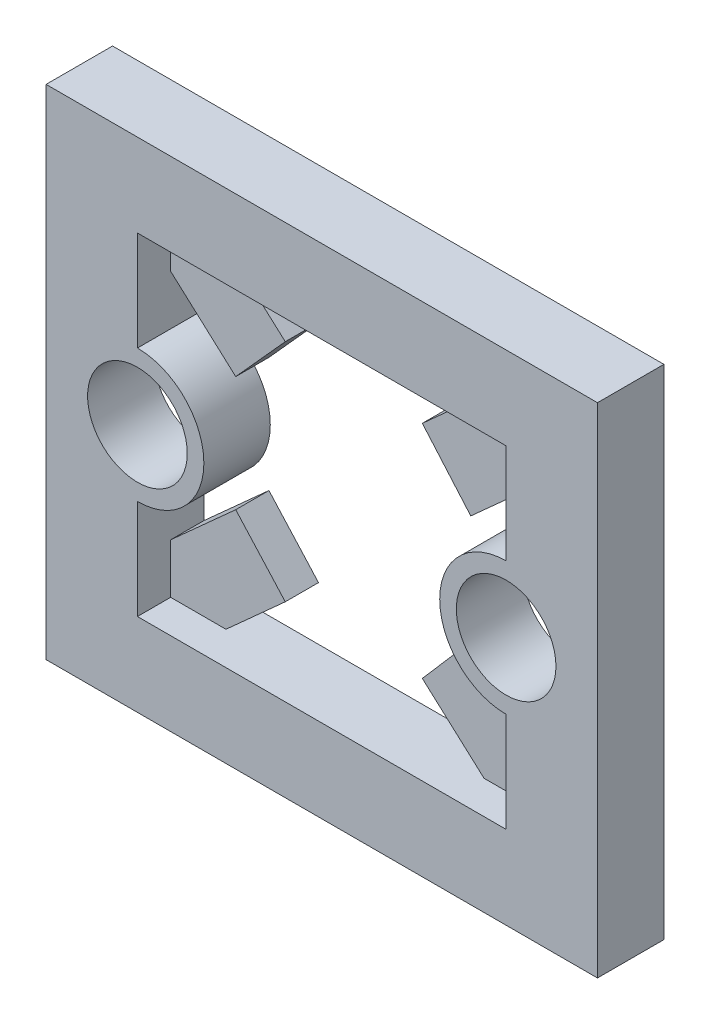
ISO-10303-21;
HEADER;
FILE_DESCRIPTION(('STEP AP214'),'2;1');
FILE_NAME('part.step','',(''),(''),'','','');
FILE_SCHEMA(('AUTOMOTIVE_DESIGN { 1 0 10303 214 1 1 1 1 }'));
ENDSEC;
DATA;
#1=APPLICATION_CONTEXT('core data for automotive mechanical design processes');
#2=APPLICATION_PROTOCOL_DEFINITION('international standard','automotive_design',2000,#1);
#3=PRODUCT_CONTEXT('',#1,'mechanical');
#4=PRODUCT('Part','Part','',(#3));
#5=PRODUCT_RELATED_PRODUCT_CATEGORY('part','',(#4));
#6=PRODUCT_DEFINITION_FORMATION('','',#4);
#7=PRODUCT_DEFINITION_CONTEXT('part definition',#1,'design');
#8=PRODUCT_DEFINITION('design','',#6,#7);
#9=PRODUCT_DEFINITION_SHAPE('','',#8);
#10=(LENGTH_UNIT() NAMED_UNIT(*) SI_UNIT(.MILLI.,.METRE.));
#11=(NAMED_UNIT(*) PLANE_ANGLE_UNIT() SI_UNIT($,.RADIAN.));
#12=(NAMED_UNIT(*) SI_UNIT($,.STERADIAN.) SOLID_ANGLE_UNIT());
#13=UNCERTAINTY_MEASURE_WITH_UNIT(LENGTH_MEASURE(1.E-05),#10,'distance_accuracy_value','');
#14=(GEOMETRIC_REPRESENTATION_CONTEXT(3) GLOBAL_UNCERTAINTY_ASSIGNED_CONTEXT((#13)) GLOBAL_UNIT_ASSIGNED_CONTEXT((#10,
#11,#12)) REPRESENTATION_CONTEXT('',''));
#15=CARTESIAN_POINT('',(0.,0.,0.));
#16=DIRECTION('',(0.,0.,1.));
#17=DIRECTION('',(1.,0.,0.));
#18=AXIS2_PLACEMENT_3D('',#15,#16,#17);
#19=CARTESIAN_POINT('',(6.908038,0.,2.));
#20=DIRECTION('',(1.,0.,0.));
#21=DIRECTION('',(0.,0.,-1.));
#22=AXIS2_PLACEMENT_3D('',#19,#20,#21);
#23=PLANE('',#22);
#24=DIRECTION('',(0.,-1.,0.));
#25=VECTOR('',#24,1.);
#26=CARTESIAN_POINT('',(6.908038,0.,1.));
#27=LINE('',#26,#25);
#28=CARTESIAN_POINT('',(6.908038,9.59496999999999,1.));
#29=VERTEX_POINT('',#28);
#30=CARTESIAN_POINT('',(6.908038,8.09496999999999,1.));
#31=VERTEX_POINT('',#30);
#32=EDGE_CURVE('E60',#29,#31,#27,.T.);
#33=ORIENTED_EDGE('',*,*,#32,.F.);
#34=DIRECTION('',(0.,0.,-1.));
#35=VECTOR('',#34,1.);
#36=CARTESIAN_POINT('',(6.908038,9.59496999999999,1.));
#37=LINE('',#36,#35);
#38=CARTESIAN_POINT('',(6.908038,9.59496999999999,0.));
#39=VERTEX_POINT('',#38);
#40=EDGE_CURVE('E234',#29,#39,#37,.T.);
#41=ORIENTED_EDGE('',*,*,#40,.T.);
#42=DIRECTION('',(0.,-1.,0.));
#43=VECTOR('',#42,1.);
#44=CARTESIAN_POINT('',(6.908038,0.,0.));
#45=LINE('',#44,#43);
#46=CARTESIAN_POINT('',(6.908038,11.09497,0.));
#47=VERTEX_POINT('',#46);
#48=EDGE_CURVE('E405',#47,#39,#45,.T.);
#49=ORIENTED_EDGE('',*,*,#48,.F.);
#50=DIRECTION('',(0.,0.,-1.));
#51=VECTOR('',#50,1.);
#52=CARTESIAN_POINT('',(6.908038,11.09497,2.));
#53=LINE('',#52,#51);
#54=CARTESIAN_POINT('',(6.908038,11.09497,2.));
#55=VERTEX_POINT('',#54);
#56=EDGE_CURVE('E387',#55,#47,#53,.T.);
#57=ORIENTED_EDGE('',*,*,#56,.F.);
#58=DIRECTION('',(0.,-1.,0.));
#59=VECTOR('',#58,1.);
#60=CARTESIAN_POINT('',(6.908038,0.,2.));
#61=LINE('',#60,#59);
#62=CARTESIAN_POINT('',(6.908038,8.09496999999999,2.));
#63=VERTEX_POINT('',#62);
#64=EDGE_CURVE('E370',#55,#63,#61,.T.);
#65=ORIENTED_EDGE('',*,*,#64,.T.);
#66=DIRECTION('',(0.,0.,-1.));
#67=VECTOR('',#66,1.);
#68=CARTESIAN_POINT('',(6.908038,8.09496999999999,2.));
#69=LINE('',#68,#67);
#70=EDGE_CURVE('E429',#63,#31,#69,.T.);
#71=ORIENTED_EDGE('',*,*,#70,.T.);
#72=EDGE_LOOP('',(#33,#41,#49,#57,#65,#71));
#73=FACE_BOUND('',#72,.T.);
#74=ADVANCED_FACE('F35',(#73),#23,.T.);
#75=CARTESIAN_POINT('',(0.,8.09496999999999,2.));
#76=DIRECTION('',(0.,-1.,0.));
#77=DIRECTION('',(1.,0.,0.));
#78=AXIS2_PLACEMENT_3D('',#75,#76,#77);
#79=PLANE('',#78);
#80=DIRECTION('',(-1.,0.,0.));
#81=VECTOR('',#80,1.);
#82=CARTESIAN_POINT('',(0.,8.09496999999999,0.));
#83=LINE('',#82,#81);
#84=CARTESIAN_POINT('',(16.3430839,8.09497,0.));
#85=VERTEX_POINT('',#84);
#86=CARTESIAN_POINT('',(8.57304610000001,8.09497,0.));
#87=VERTEX_POINT('',#86);
#88=EDGE_CURVE('E403',#85,#87,#83,.T.);
#89=ORIENTED_EDGE('',*,*,#88,.T.);
#90=DIRECTION('',(0.,0.,-1.));
#91=VECTOR('',#90,1.);
#92=CARTESIAN_POINT('',(8.57304610000001,8.09497,1.));
#93=LINE('',#92,#91);
#94=CARTESIAN_POINT('',(8.57304610000001,8.09496999999999,1.));
#95=VERTEX_POINT('',#94);
#96=EDGE_CURVE('E52',#95,#87,#93,.T.);
#97=ORIENTED_EDGE('',*,*,#96,.F.);
#98=DIRECTION('',(-1.,0.,0.));
#99=VECTOR('',#98,1.);
#100=CARTESIAN_POINT('',(0.,8.09496999999999,1.));
#101=LINE('',#100,#99);
#102=EDGE_CURVE('E251',#95,#31,#101,.T.);
#103=ORIENTED_EDGE('',*,*,#102,.T.);
#104=ORIENTED_EDGE('',*,*,#70,.F.);
#105=DIRECTION('',(-1.,0.,0.));
#106=VECTOR('',#105,1.);
#107=CARTESIAN_POINT('',(0.,8.09496999999999,2.));
#108=LINE('',#107,#106);
#109=CARTESIAN_POINT('',(18.008092,8.09497,2.));
#110=VERTEX_POINT('',#109);
#111=EDGE_CURVE('E368',#110,#63,#108,.T.);
#112=ORIENTED_EDGE('',*,*,#111,.F.);
#113=DIRECTION('',(0.,0.,-1.));
#114=VECTOR('',#113,1.);
#115=CARTESIAN_POINT('',(18.008092,8.09497,2.));
#116=LINE('',#115,#114);
#117=CARTESIAN_POINT('',(18.008092,8.09497,1.));
#118=VERTEX_POINT('',#117);
#119=EDGE_CURVE('E431',#110,#118,#116,.T.);
#120=ORIENTED_EDGE('',*,*,#119,.T.);
#121=DIRECTION('',(-1.,0.,0.));
#122=VECTOR('',#121,1.);
#123=CARTESIAN_POINT('',(0.,8.09496999999999,1.));
#124=LINE('',#123,#122);
#125=CARTESIAN_POINT('',(16.3430839,8.09497,1.));
#126=VERTEX_POINT('',#125);
#127=EDGE_CURVE('E270',#118,#126,#124,.T.);
#128=ORIENTED_EDGE('',*,*,#127,.T.);
#129=DIRECTION('',(0.,0.,-1.));
#130=VECTOR('',#129,1.);
#131=CARTESIAN_POINT('',(16.3430839,8.09497,1.));
#132=LINE('',#131,#130);
#133=EDGE_CURVE('E284',#126,#85,#132,.T.);
#134=ORIENTED_EDGE('',*,*,#133,.T.);
#135=EDGE_LOOP('',(#89,#97,#103,#104,#112,#120,#128,#134));
#136=FACE_BOUND('',#135,.T.);
#137=ADVANCED_FACE('F469',(#136),#79,.F.);
#138=CARTESIAN_POINT('',(18.008092,0.,2.));
#139=DIRECTION('',(1.,0.,0.));
#140=DIRECTION('',(0.,0.,-1.));
#141=AXIS2_PLACEMENT_3D('',#138,#139,#140);
#142=PLANE('',#141);
#143=DIRECTION('',(0.,0.,-1.));
#144=VECTOR('',#143,1.);
#145=CARTESIAN_POINT('',(18.008092,16.59497,1.));
#146=LINE('',#145,#144);
#147=CARTESIAN_POINT('',(18.008092,16.59497,1.));
#148=VERTEX_POINT('',#147);
#149=CARTESIAN_POINT('',(18.008092,16.59497,0.));
#150=VERTEX_POINT('',#149);
#151=EDGE_CURVE('E313',#148,#150,#146,.T.);
#152=ORIENTED_EDGE('',*,*,#151,.T.);
#153=DIRECTION('',(0.,-1.,0.));
#154=VECTOR('',#153,1.);
#155=CARTESIAN_POINT('',(18.008092,0.,0.));
#156=LINE('',#155,#154);
#157=CARTESIAN_POINT('',(18.008092,15.09497,0.));
#158=VERTEX_POINT('',#157);
#159=EDGE_CURVE('E397',#150,#158,#156,.T.);
#160=ORIENTED_EDGE('',*,*,#159,.T.);
#161=DIRECTION('',(0.,0.,-1.));
#162=VECTOR('',#161,1.);
#163=CARTESIAN_POINT('',(18.008092,15.09497,2.));
#164=LINE('',#163,#162);
#165=CARTESIAN_POINT('',(18.008092,15.09497,2.));
#166=VERTEX_POINT('',#165);
#167=EDGE_CURVE('E437',#166,#158,#164,.T.);
#168=ORIENTED_EDGE('',*,*,#167,.F.);
#169=DIRECTION('',(0.,-1.,0.));
#170=VECTOR('',#169,1.);
#171=CARTESIAN_POINT('',(18.008092,0.,2.));
#172=LINE('',#171,#170);
#173=CARTESIAN_POINT('',(18.008092,18.09497,2.));
#174=VERTEX_POINT('',#173);
#175=EDGE_CURVE('E362',#174,#166,#172,.T.);
#176=ORIENTED_EDGE('',*,*,#175,.F.);
#177=DIRECTION('',(0.,0.,-1.));
#178=VECTOR('',#177,1.);
#179=CARTESIAN_POINT('',(18.008092,18.09497,2.));
#180=LINE('',#179,#178);
#181=CARTESIAN_POINT('',(18.008092,18.09497,1.));
#182=VERTEX_POINT('',#181);
#183=EDGE_CURVE('E440',#174,#182,#180,.T.);
#184=ORIENTED_EDGE('',*,*,#183,.T.);
#185=DIRECTION('',(0.,-1.,0.));
#186=VECTOR('',#185,1.);
#187=CARTESIAN_POINT('',(18.008092,0.,1.));
#188=LINE('',#187,#186);
#189=EDGE_CURVE('E300',#182,#148,#188,.T.);
#190=ORIENTED_EDGE('',*,*,#189,.T.);
#191=EDGE_LOOP('',(#152,#160,#168,#176,#184,#190));
#192=FACE_BOUND('',#191,.T.);
#193=ADVANCED_FACE('F546',(#192),#142,.F.);
#194=CARTESIAN_POINT('',(0.,18.09497,2.));
#195=DIRECTION('',(0.,1.,0.));
#196=DIRECTION('',(0.,0.,1.));
#197=AXIS2_PLACEMENT_3D('',#194,#195,#196);
#198=PLANE('',#197);
#199=DIRECTION('',(1.,0.,0.));
#200=VECTOR('',#199,1.);
#201=CARTESIAN_POINT('',(0.,18.09497,0.));
#202=LINE('',#201,#200);
#203=CARTESIAN_POINT('',(8.57304609999999,18.09497,0.));
#204=VERTEX_POINT('',#203);
#205=CARTESIAN_POINT('',(16.3430839,18.09497,0.));
#206=VERTEX_POINT('',#205);
#207=EDGE_CURVE('E395',#204,#206,#202,.T.);
#208=ORIENTED_EDGE('',*,*,#207,.T.);
#209=DIRECTION('',(0.,0.,-1.));
#210=VECTOR('',#209,1.);
#211=CARTESIAN_POINT('',(16.3430839,18.09497,1.));
#212=LINE('',#211,#210);
#213=CARTESIAN_POINT('',(16.3430839,18.09497,1.));
#214=VERTEX_POINT('',#213);
#215=EDGE_CURVE('E304',#214,#206,#212,.T.);
#216=ORIENTED_EDGE('',*,*,#215,.F.);
#217=DIRECTION('',(1.,0.,0.));
#218=VECTOR('',#217,1.);
#219=CARTESIAN_POINT('',(0.,18.09497,1.));
#220=LINE('',#219,#218);
#221=EDGE_CURVE('E302',#214,#182,#220,.T.);
#222=ORIENTED_EDGE('',*,*,#221,.T.);
#223=ORIENTED_EDGE('',*,*,#183,.F.);
#224=DIRECTION('',(1.,0.,0.));
#225=VECTOR('',#224,1.);
#226=CARTESIAN_POINT('',(0.,18.09497,2.));
#227=LINE('',#226,#225);
#228=CARTESIAN_POINT('',(6.908038,18.09497,2.));
#229=VERTEX_POINT('',#228);
#230=EDGE_CURVE('E360',#229,#174,#227,.T.);
#231=ORIENTED_EDGE('',*,*,#230,.F.);
#232=DIRECTION('',(0.,0.,-1.));
#233=VECTOR('',#232,1.);
#234=CARTESIAN_POINT('',(6.908038,18.09497,2.));
#235=LINE('',#234,#233);
#236=CARTESIAN_POINT('',(6.908038,18.09497,1.));
#237=VERTEX_POINT('',#236);
#238=EDGE_CURVE('E442',#229,#237,#235,.T.);
#239=ORIENTED_EDGE('',*,*,#238,.T.);
#240=DIRECTION('',(1.,0.,0.));
#241=VECTOR('',#240,1.);
#242=CARTESIAN_POINT('',(0.,18.09497,1.));
#243=LINE('',#242,#241);
#244=CARTESIAN_POINT('',(8.5730461,18.09497,1.));
#245=VERTEX_POINT('',#244);
#246=EDGE_CURVE('E330',#237,#245,#243,.T.);
#247=ORIENTED_EDGE('',*,*,#246,.T.);
#248=DIRECTION('',(0.,0.,-1.));
#249=VECTOR('',#248,1.);
#250=CARTESIAN_POINT('',(8.57304609999999,18.09497,1.));
#251=LINE('',#250,#249);
#252=EDGE_CURVE('E343',#245,#204,#251,.T.);
#253=ORIENTED_EDGE('',*,*,#252,.T.);
#254=EDGE_LOOP('',(#208,#216,#222,#223,#231,#239,#247,#253));
#255=FACE_BOUND('',#254,.T.);
#256=ADVANCED_FACE('F514',(#255),#198,.F.);
#257=CARTESIAN_POINT('',(20.758092,0.,2.));
#258=DIRECTION('',(1.,0.,0.));
#259=DIRECTION('',(0.,1.,0.));
#260=AXIS2_PLACEMENT_3D('',#257,#258,#259);
#261=PLANE('',#260);
#262=DIRECTION('',(0.,-1.,0.));
#263=VECTOR('',#262,1.);
#264=CARTESIAN_POINT('',(20.758092,0.,0.));
#265=LINE('',#264,#263);
#266=CARTESIAN_POINT('',(20.758092,20.59497,0.));
#267=VERTEX_POINT('',#266);
#268=CARTESIAN_POINT('',(20.758092,5.59497,0.));
#269=VERTEX_POINT('',#268);
#270=EDGE_CURVE('E408',#267,#269,#265,.T.);
#271=ORIENTED_EDGE('',*,*,#270,.F.);
#272=DIRECTION('',(0.,0.,-1.));
#273=VECTOR('',#272,1.);
#274=CARTESIAN_POINT('',(20.758092,20.59497,2.));
#275=LINE('',#274,#273);
#276=CARTESIAN_POINT('',(20.758092,20.59497,2.));
#277=VERTEX_POINT('',#276);
#278=EDGE_CURVE('E11',#277,#267,#275,.T.);
#279=ORIENTED_EDGE('',*,*,#278,.F.);
#280=DIRECTION('',(0.,-1.,0.));
#281=VECTOR('',#280,1.);
#282=CARTESIAN_POINT('',(20.758092,0.,2.));
#283=LINE('',#282,#281);
#284=CARTESIAN_POINT('',(20.758092,5.59497,2.));
#285=VERTEX_POINT('',#284);
#286=EDGE_CURVE('E373',#277,#285,#283,.T.);
#287=ORIENTED_EDGE('',*,*,#286,.T.);
#288=DIRECTION('',(0.,0.,-1.));
#289=VECTOR('',#288,1.);
#290=CARTESIAN_POINT('',(20.758092,5.59497,2.));
#291=LINE('',#290,#289);
#292=EDGE_CURVE('E422',#285,#269,#291,.T.);
#293=ORIENTED_EDGE('',*,*,#292,.T.);
#294=EDGE_LOOP('',(#271,#279,#287,#293));
#295=FACE_BOUND('',#294,.T.);
#296=ADVANCED_FACE('F549',(#295),#261,.T.);
#297=CARTESIAN_POINT('',(0.,20.59497,2.));
#298=DIRECTION('',(0.,1.,0.));
#299=DIRECTION('',(0.,0.,1.));
#300=AXIS2_PLACEMENT_3D('',#297,#298,#299);
#301=PLANE('',#300);
#302=DIRECTION('',(1.,0.,0.));
#303=VECTOR('',#302,1.);
#304=CARTESIAN_POINT('',(0.,20.59497,0.));
#305=LINE('',#304,#303);
#306=CARTESIAN_POINT('',(4.158038,20.59497,0.));
#307=VERTEX_POINT('',#306);
#308=EDGE_CURVE('E411',#307,#267,#305,.T.);
#309=ORIENTED_EDGE('',*,*,#308,.F.);
#310=DIRECTION('',(0.,0.,-1.));
#311=VECTOR('',#310,1.);
#312=CARTESIAN_POINT('',(4.158038,20.59497,2.));
#313=LINE('',#312,#311);
#314=CARTESIAN_POINT('',(4.158038,20.59497,2.));
#315=VERTEX_POINT('',#314);
#316=EDGE_CURVE('E44',#315,#307,#313,.T.);
#317=ORIENTED_EDGE('',*,*,#316,.F.);
#318=DIRECTION('',(1.,0.,0.));
#319=VECTOR('',#318,1.);
#320=CARTESIAN_POINT('',(0.,20.59497,2.));
#321=LINE('',#320,#319);
#322=EDGE_CURVE('E376',#315,#277,#321,.T.);
#323=ORIENTED_EDGE('',*,*,#322,.T.);
#324=ORIENTED_EDGE('',*,*,#278,.T.);
#325=EDGE_LOOP('',(#309,#317,#323,#324));
#326=FACE_BOUND('',#325,.T.);
#327=ADVANCED_FACE('F567',(#326),#301,.T.);
#328=CARTESIAN_POINT('',(4.158038,0.,2.));
#329=DIRECTION('',(1.,0.,0.));
#330=DIRECTION('',(0.,0.,-1.));
#331=AXIS2_PLACEMENT_3D('',#328,#329,#330);
#332=PLANE('',#331);
#333=DIRECTION('',(0.,-1.,0.));
#334=VECTOR('',#333,1.);
#335=CARTESIAN_POINT('',(4.158038,0.,0.));
#336=LINE('',#335,#334);
#337=CARTESIAN_POINT('',(4.158038,5.59497,0.));
#338=VERTEX_POINT('',#337);
#339=EDGE_CURVE('E414',#307,#338,#336,.T.);
#340=ORIENTED_EDGE('',*,*,#339,.T.);
#341=DIRECTION('',(0.,0.,-1.));
#342=VECTOR('',#341,1.);
#343=CARTESIAN_POINT('',(4.158038,5.59497,2.));
#344=LINE('',#343,#342);
#345=CARTESIAN_POINT('',(4.158038,5.59497,2.));
#346=VERTEX_POINT('',#345);
#347=EDGE_CURVE('E424',#346,#338,#344,.T.);
#348=ORIENTED_EDGE('',*,*,#347,.F.);
#349=DIRECTION('',(0.,-1.,0.));
#350=VECTOR('',#349,1.);
#351=CARTESIAN_POINT('',(4.158038,0.,2.));
#352=LINE('',#351,#350);
#353=EDGE_CURVE('E379',#315,#346,#352,.T.);
#354=ORIENTED_EDGE('',*,*,#353,.F.);
#355=ORIENTED_EDGE('',*,*,#316,.T.);
#356=EDGE_LOOP('',(#340,#348,#354,#355));
#357=FACE_BOUND('',#356,.T.);
#358=ADVANCED_FACE('F563',(#357),#332,.F.);
#359=CARTESIAN_POINT('',(6.908038,13.09497,2.));
#360=DIRECTION('',(0.,0.,-1.));
#361=DIRECTION('',(-1.,0.,0.));
#362=AXIS2_PLACEMENT_3D('',#359,#360,#361);
#363=CYLINDRICAL_SURFACE('',#362,2.);
#364=CARTESIAN_POINT('',(6.908038,13.09497,0.));
#365=DIRECTION('',(0.,0.,1.));
#366=DIRECTION('',(1.,0.,0.));
#367=AXIS2_PLACEMENT_3D('',#364,#365,#366);
#368=CIRCLE('',#367,2.);
#369=CARTESIAN_POINT('',(6.908038,15.09497,0.));
#370=VERTEX_POINT('',#369);
#371=EDGE_CURVE('E390',#47,#370,#368,.T.);
#372=ORIENTED_EDGE('',*,*,#371,.T.);
#373=DIRECTION('',(0.,0.,-1.));
#374=VECTOR('',#373,1.);
#375=CARTESIAN_POINT('',(6.908038,15.09497,2.));
#376=LINE('',#375,#374);
#377=CARTESIAN_POINT('',(6.908038,15.09497,2.));
#378=VERTEX_POINT('',#377);
#379=EDGE_CURVE('E39',#378,#370,#376,.T.);
#380=ORIENTED_EDGE('',*,*,#379,.F.);
#381=CARTESIAN_POINT('',(6.908038,13.09497,2.));
#382=DIRECTION('',(0.,0.,1.));
#383=DIRECTION('',(1.,0.,0.));
#384=AXIS2_PLACEMENT_3D('',#381,#382,#383);
#385=CIRCLE('',#384,2.);
#386=EDGE_CURVE('E354',#55,#378,#385,.T.);
#387=ORIENTED_EDGE('',*,*,#386,.F.);
#388=ORIENTED_EDGE('',*,*,#56,.T.);
#389=EDGE_LOOP('',(#372,#380,#387,#388));
#390=FACE_BOUND('',#389,.T.);
#391=ADVANCED_FACE('F455',(#390),#363,.T.);
#392=CARTESIAN_POINT('',(6.908038,0.,2.));
#393=DIRECTION('',(-1.,0.,0.));
#394=DIRECTION('',(0.,-1.,0.));
#395=AXIS2_PLACEMENT_3D('',#392,#393,#394);
#396=PLANE('',#395);
#397=DIRECTION('',(0.,1.,0.));
#398=VECTOR('',#397,1.);
#399=CARTESIAN_POINT('',(6.908038,0.,0.));
#400=LINE('',#399,#398);
#401=CARTESIAN_POINT('',(6.908038,16.59497,0.));
#402=VERTEX_POINT('',#401);
#403=EDGE_CURVE('E393',#370,#402,#400,.T.);
#404=ORIENTED_EDGE('',*,*,#403,.T.);
#405=DIRECTION('',(0.,0.,-1.));
#406=VECTOR('',#405,1.);
#407=CARTESIAN_POINT('',(6.908038,16.59497,1.));
#408=LINE('',#407,#406);
#409=CARTESIAN_POINT('',(6.908038,16.59497,1.));
#410=VERTEX_POINT('',#409);
#411=EDGE_CURVE('E334',#410,#402,#408,.T.);
#412=ORIENTED_EDGE('',*,*,#411,.F.);
#413=DIRECTION('',(0.,1.,0.));
#414=VECTOR('',#413,1.);
#415=CARTESIAN_POINT('',(6.908038,0.,1.));
#416=LINE('',#415,#414);
#417=EDGE_CURVE('E332',#410,#237,#416,.T.);
#418=ORIENTED_EDGE('',*,*,#417,.T.);
#419=ORIENTED_EDGE('',*,*,#238,.F.);
#420=DIRECTION('',(0.,1.,0.));
#421=VECTOR('',#420,1.);
#422=CARTESIAN_POINT('',(6.908038,0.,2.));
#423=LINE('',#422,#421);
#424=EDGE_CURVE('E358',#378,#229,#423,.T.);
#425=ORIENTED_EDGE('',*,*,#424,.F.);
#426=ORIENTED_EDGE('',*,*,#379,.T.);
#427=EDGE_LOOP('',(#404,#412,#418,#419,#425,#426));
#428=FACE_BOUND('',#427,.T.);
#429=ADVANCED_FACE('F451',(#428),#396,.F.);
#430=CARTESIAN_POINT('',(18.008092,13.09497,2.));
#431=DIRECTION('',(0.,0.,-1.));
#432=DIRECTION('',(-1.,0.,0.));
#433=AXIS2_PLACEMENT_3D('',#430,#431,#432);
#434=CYLINDRICAL_SURFACE('',#433,2.);
#435=CARTESIAN_POINT('',(18.008092,13.09497,0.));
#436=DIRECTION('',(0.,0.,1.));
#437=DIRECTION('',(1.,0.,0.));
#438=AXIS2_PLACEMENT_3D('',#435,#436,#437);
#439=CIRCLE('',#438,2.);
#440=CARTESIAN_POINT('',(18.008092,11.09497,0.));
#441=VERTEX_POINT('',#440);
#442=EDGE_CURVE('E399',#158,#441,#439,.T.);
#443=ORIENTED_EDGE('',*,*,#442,.T.);
#444=DIRECTION('',(0.,0.,-1.));
#445=VECTOR('',#444,1.);
#446=CARTESIAN_POINT('',(18.008092,11.09497,2.));
#447=LINE('',#446,#445);
#448=CARTESIAN_POINT('',(18.008092,11.09497,2.));
#449=VERTEX_POINT('',#448);
#450=EDGE_CURVE('E434',#449,#441,#447,.T.);
#451=ORIENTED_EDGE('',*,*,#450,.F.);
#452=CARTESIAN_POINT('',(18.008092,13.09497,2.));
#453=DIRECTION('',(0.,0.,1.));
#454=DIRECTION('',(1.,0.,0.));
#455=AXIS2_PLACEMENT_3D('',#452,#453,#454);
#456=CIRCLE('',#455,2.);
#457=EDGE_CURVE('E364',#166,#449,#456,.T.);
#458=ORIENTED_EDGE('',*,*,#457,.F.);
#459=ORIENTED_EDGE('',*,*,#167,.T.);
#460=EDGE_LOOP('',(#443,#451,#458,#459));
#461=FACE_BOUND('',#460,.T.);
#462=ADVANCED_FACE('F494',(#461),#434,.T.);
#463=CARTESIAN_POINT('',(18.008092,0.,2.));
#464=DIRECTION('',(1.,0.,0.));
#465=DIRECTION('',(0.,0.,-1.));
#466=AXIS2_PLACEMENT_3D('',#463,#464,#465);
#467=PLANE('',#466);
#468=DIRECTION('',(0.,-1.,0.));
#469=VECTOR('',#468,1.);
#470=CARTESIAN_POINT('',(18.008092,0.,0.));
#471=LINE('',#470,#469);
#472=CARTESIAN_POINT('',(18.008092,9.59496999999999,0.));
#473=VERTEX_POINT('',#472);
#474=EDGE_CURVE('E401',#441,#473,#471,.T.);
#475=ORIENTED_EDGE('',*,*,#474,.T.);
#476=DIRECTION('',(0.,0.,-1.));
#477=VECTOR('',#476,1.);
#478=CARTESIAN_POINT('',(18.008092,9.59496999999999,1.));
#479=LINE('',#478,#477);
#480=CARTESIAN_POINT('',(18.008092,9.59496999999999,1.));
#481=VERTEX_POINT('',#480);
#482=EDGE_CURVE('E274',#481,#473,#479,.T.);
#483=ORIENTED_EDGE('',*,*,#482,.F.);
#484=DIRECTION('',(0.,-1.,0.));
#485=VECTOR('',#484,1.);
#486=CARTESIAN_POINT('',(18.008092,0.,1.));
#487=LINE('',#486,#485);
#488=EDGE_CURVE('E272',#481,#118,#487,.T.);
#489=ORIENTED_EDGE('',*,*,#488,.T.);
#490=ORIENTED_EDGE('',*,*,#119,.F.);
#491=DIRECTION('',(0.,-1.,0.));
#492=VECTOR('',#491,1.);
#493=CARTESIAN_POINT('',(18.008092,0.,2.));
#494=LINE('',#493,#492);
#495=EDGE_CURVE('E366',#449,#110,#494,.T.);
#496=ORIENTED_EDGE('',*,*,#495,.F.);
#497=ORIENTED_EDGE('',*,*,#450,.T.);
#498=EDGE_LOOP('',(#475,#483,#489,#490,#496,#497));
#499=FACE_BOUND('',#498,.T.);
#500=ADVANCED_FACE('F490',(#499),#467,.F.);
#501=CARTESIAN_POINT('',(0.,5.59497,2.));
#502=DIRECTION('',(0.,1.,0.));
#503=DIRECTION('',(0.,0.,1.));
#504=AXIS2_PLACEMENT_3D('',#501,#502,#503);
#505=PLANE('',#504);
#506=DIRECTION('',(1.,0.,0.));
#507=VECTOR('',#506,1.);
#508=CARTESIAN_POINT('',(0.,5.59497,0.));
#509=LINE('',#508,#507);
#510=EDGE_CURVE('E417',#338,#269,#509,.T.);
#511=ORIENTED_EDGE('',*,*,#510,.T.);
#512=ORIENTED_EDGE('',*,*,#292,.F.);
#513=DIRECTION('',(1.,0.,0.));
#514=VECTOR('',#513,1.);
#515=CARTESIAN_POINT('',(0.,5.59497,2.));
#516=LINE('',#515,#514);
#517=EDGE_CURVE('E382',#346,#285,#516,.T.);
#518=ORIENTED_EDGE('',*,*,#517,.F.);
#519=ORIENTED_EDGE('',*,*,#347,.T.);
#520=EDGE_LOOP('',(#511,#512,#518,#519));
#521=FACE_BOUND('',#520,.T.);
#522=ADVANCED_FACE('F554',(#521),#505,.F.);
#523=CARTESIAN_POINT('',(6.908038,13.09497,2.));
#524=DIRECTION('',(0.,0.,-1.));
#525=DIRECTION('',(-1.,0.,0.));
#526=AXIS2_PLACEMENT_3D('',#523,#524,#525);
#527=CYLINDRICAL_SURFACE('',#526,1.5);
#528=CARTESIAN_POINT('',(6.908038,13.09497,2.));
#529=DIRECTION('',(0.,0.,1.));
#530=DIRECTION('',(1.,0.,0.));
#531=AXIS2_PLACEMENT_3D('',#528,#529,#530);
#532=CIRCLE('',#531,1.5);
#533=CARTESIAN_POINT('',(8.408038,13.09497,2.));
#534=VERTEX_POINT('',#533);
#535=EDGE_CURVE('E351',#534,#534,#532,.T.);
#536=ORIENTED_EDGE('',*,*,#535,.T.);
#537=EDGE_LOOP('',(#536));
#538=FACE_BOUND('',#537,.T.);
#539=CARTESIAN_POINT('',(6.908038,13.09497,0.));
#540=DIRECTION('',(0.,0.,1.));
#541=DIRECTION('',(1.,0.,0.));
#542=AXIS2_PLACEMENT_3D('',#539,#540,#541);
#543=CIRCLE('',#542,1.5);
#544=CARTESIAN_POINT('',(8.408038,13.09497,0.));
#545=VERTEX_POINT('',#544);
#546=EDGE_CURVE('E350',#545,#545,#543,.T.);
#547=ORIENTED_EDGE('',*,*,#546,.F.);
#548=EDGE_LOOP('',(#547));
#549=FACE_BOUND('',#548,.T.);
#550=ADVANCED_FACE('F37',(#538,#549),#527,.F.);
#551=CARTESIAN_POINT('',(18.008092,13.09497,2.));
#552=DIRECTION('',(0.,0.,-1.));
#553=DIRECTION('',(-1.,0.,0.));
#554=AXIS2_PLACEMENT_3D('',#551,#552,#553);
#555=CYLINDRICAL_SURFACE('',#554,1.5);
#556=CARTESIAN_POINT('',(18.008092,13.09497,2.));
#557=DIRECTION('',(0.,0.,1.));
#558=DIRECTION('',(1.,0.,0.));
#559=AXIS2_PLACEMENT_3D('',#556,#557,#558);
#560=CIRCLE('',#559,1.5);
#561=CARTESIAN_POINT('',(19.508092,13.09497,2.));
#562=VERTEX_POINT('',#561);
#563=EDGE_CURVE('E384',#562,#562,#560,.T.);
#564=ORIENTED_EDGE('',*,*,#563,.T.);
#565=EDGE_LOOP('',(#564));
#566=FACE_BOUND('',#565,.T.);
#567=CARTESIAN_POINT('',(18.008092,13.09497,0.));
#568=DIRECTION('',(0.,0.,1.));
#569=DIRECTION('',(1.,0.,0.));
#570=AXIS2_PLACEMENT_3D('',#567,#568,#569);
#571=CIRCLE('',#570,1.5);
#572=CARTESIAN_POINT('',(19.508092,13.09497,0.));
#573=VERTEX_POINT('',#572);
#574=EDGE_CURVE('E355',#573,#573,#571,.T.);
#575=ORIENTED_EDGE('',*,*,#574,.F.);
#576=EDGE_LOOP('',(#575));
#577=FACE_BOUND('',#576,.T.);
#578=ADVANCED_FACE('F578',(#566,#577),#555,.F.);
#579=CARTESIAN_POINT('',(0.,0.,2.));
#580=DIRECTION('',(0.,0.,1.));
#581=DIRECTION('',(1.,0.,0.));
#582=AXIS2_PLACEMENT_3D('',#579,#580,#581);
#583=PLANE('',#582);
#584=ORIENTED_EDGE('',*,*,#535,.F.);
#585=EDGE_LOOP('',(#584));
#586=FACE_BOUND('',#585,.T.);
#587=ORIENTED_EDGE('',*,*,#386,.T.);
#588=ORIENTED_EDGE('',*,*,#424,.T.);
#589=ORIENTED_EDGE('',*,*,#230,.T.);
#590=ORIENTED_EDGE('',*,*,#175,.T.);
#591=ORIENTED_EDGE('',*,*,#457,.T.);
#592=ORIENTED_EDGE('',*,*,#495,.T.);
#593=ORIENTED_EDGE('',*,*,#111,.T.);
#594=ORIENTED_EDGE('',*,*,#64,.F.);
#595=EDGE_LOOP('',(#587,#588,#589,#590,#591,#592,#593,#594));
#596=FACE_BOUND('',#595,.T.);
#597=ORIENTED_EDGE('',*,*,#286,.F.);
#598=ORIENTED_EDGE('',*,*,#322,.F.);
#599=ORIENTED_EDGE('',*,*,#353,.T.);
#600=ORIENTED_EDGE('',*,*,#517,.T.);
#601=EDGE_LOOP('',(#597,#598,#599,#600));
#602=FACE_BOUND('',#601,.T.);
#603=ORIENTED_EDGE('',*,*,#563,.F.);
#604=EDGE_LOOP('',(#603));
#605=FACE_BOUND('',#604,.T.);
#606=ADVANCED_FACE('F463',(#586,#596,#602,#605),#583,.T.);
#607=CARTESIAN_POINT('',(0.,0.,0.));
#608=DIRECTION('',(0.,0.,1.));
#609=DIRECTION('',(1.,0.,0.));
#610=AXIS2_PLACEMENT_3D('',#607,#608,#609);
#611=PLANE('',#610);
#612=ORIENTED_EDGE('',*,*,#88,.F.);
#613=DIRECTION('',(0.74296285530282,-0.669332649465332,0.));
#614=VECTOR('',#613,1.);
#615=CARTESIAN_POINT('',(11.3473447787008,12.5956139800196,0.));
#616=LINE('',#615,#614);
#617=CARTESIAN_POINT('',(14.4851039378158,9.76881767874485,0.));
#618=VERTEX_POINT('',#617);
#619=EDGE_CURVE('E264',#618,#85,#616,.T.);
#620=ORIENTED_EDGE('',*,*,#619,.F.);
#621=DIRECTION('',(0.654156678876388,0.756359067825205,0.));
#622=VECTOR('',#621,1.);
#623=CARTESIAN_POINT('',(3.45323476207376,-2.9866192915938,0.));
#624=LINE('',#623,#622);
#625=CARTESIAN_POINT('',(15.9434450708733,11.4550032296822,0.));
#626=VERTEX_POINT('',#625);
#627=EDGE_CURVE('E277',#618,#626,#624,.T.);
#628=ORIENTED_EDGE('',*,*,#627,.T.);
#629=DIRECTION('',(0.742962855302822,-0.66933264946533,0.));
#630=VECTOR('',#629,1.);
#631=CARTESIAN_POINT('',(12.8392126678832,14.2515953930988,0.));
#632=LINE('',#631,#630);
#633=EDGE_CURVE('E233',#626,#473,#632,.T.);
#634=ORIENTED_EDGE('',*,*,#633,.T.);
#635=ORIENTED_EDGE('',*,*,#474,.F.);
#636=ORIENTED_EDGE('',*,*,#442,.F.);
#637=ORIENTED_EDGE('',*,*,#159,.F.);
#638=DIRECTION('',(0.742962855302822,0.669332649465329,0.));
#639=VECTOR('',#638,1.);
#640=CARTESIAN_POINT('',(-0.184764167322147,0.205089223454086,0.));
#641=LINE('',#640,#639);
#642=CARTESIAN_POINT('',(15.9434450708733,14.7349367703178,0.));
#643=VERTEX_POINT('',#642);
#644=EDGE_CURVE('E295',#643,#150,#641,.T.);
#645=ORIENTED_EDGE('',*,*,#644,.F.);
#646=DIRECTION('',(0.654156678876388,-0.756359067825205,0.));
#647=VECTOR('',#646,1.);
#648=CARTESIAN_POINT('',(16.4114235012555,14.1938435723179,0.));
#649=LINE('',#648,#647);
#650=CARTESIAN_POINT('',(14.4851039378158,16.4211223212551,0.));
#651=VERTEX_POINT('',#650);
#652=EDGE_CURVE('E307',#651,#643,#649,.T.);
#653=ORIENTED_EDGE('',*,*,#652,.F.);
#654=DIRECTION('',(0.742962855302823,0.669332649465328,0.));
#655=VECTOR('',#654,1.);
#656=CARTESIAN_POINT('',(-1.67663205650466,1.86107063653328,0.));
#657=LINE('',#656,#655);
#658=EDGE_CURVE('E290',#651,#206,#657,.T.);
#659=ORIENTED_EDGE('',*,*,#658,.T.);
#660=ORIENTED_EDGE('',*,*,#207,.F.);
#661=DIRECTION('',(-0.742962855302823,0.669332649465329,0.));
#662=VECTOR('',#661,1.);
#663=CARTESIAN_POINT('',(12.8392126678832,14.2515953930988,0.));
#664=LINE('',#663,#662);
#665=CARTESIAN_POINT('',(10.3588458423802,16.4861492299567,0.));
#666=VERTEX_POINT('',#665);
#667=EDGE_CURVE('E325',#666,#204,#664,.T.);
#668=ORIENTED_EDGE('',*,*,#667,.F.);
#669=DIRECTION('',(0.669332649465329,0.742962855302823,0.));
#670=VECTOR('',#669,1.);
#671=CARTESIAN_POINT('',(-2.48036682550303,2.23455383685793,0.));
#672=LINE('',#671,#670);
#673=CARTESIAN_POINT('',(8.8669779531977,14.8301678168776,0.));
#674=VERTEX_POINT('',#673);
#675=EDGE_CURVE('E337',#674,#666,#672,.T.);
#676=ORIENTED_EDGE('',*,*,#675,.F.);
#677=DIRECTION('',(-0.742962855302822,0.66933264946533,0.));
#678=VECTOR('',#677,1.);
#679=CARTESIAN_POINT('',(11.3473447787007,12.5956139800196,0.));
#680=LINE('',#679,#678);
#681=EDGE_CURVE('E320',#674,#402,#680,.T.);
#682=ORIENTED_EDGE('',*,*,#681,.T.);
#683=ORIENTED_EDGE('',*,*,#403,.F.);
#684=ORIENTED_EDGE('',*,*,#371,.F.);
#685=ORIENTED_EDGE('',*,*,#48,.T.);
#686=DIRECTION('',(-0.742962855302821,-0.669332649465331,0.));
#687=VECTOR('',#686,1.);
#688=CARTESIAN_POINT('',(-1.67663205650462,1.86107063653322,0.));
#689=LINE('',#688,#687);
#690=CARTESIAN_POINT('',(8.8669779531977,11.3597721831224,0.));
#691=VERTEX_POINT('',#690);
#692=EDGE_CURVE('E247',#691,#39,#689,.T.);
#693=ORIENTED_EDGE('',*,*,#692,.F.);
#694=DIRECTION('',(0.669332649465329,-0.742962855302823,0.));
#695=VECTOR('',#694,1.);
#696=CARTESIAN_POINT('',(10.5436100097023,9.49870154658918,0.));
#697=LINE('',#696,#695);
#698=CARTESIAN_POINT('',(10.3588458423802,9.70379077004327,0.));
#699=VERTEX_POINT('',#698);
#700=EDGE_CURVE('E229',#691,#699,#697,.T.);
#701=ORIENTED_EDGE('',*,*,#700,.T.);
#702=DIRECTION('',(-0.74296285530282,-0.669332649465332,0.));
#703=VECTOR('',#702,1.);
#704=CARTESIAN_POINT('',(-0.184764167322118,0.205089223454053,0.));
#705=LINE('',#704,#703);
#706=EDGE_CURVE('E244',#699,#87,#705,.T.);
#707=ORIENTED_EDGE('',*,*,#706,.T.);
#708=EDGE_LOOP('',(#612,#620,#628,#634,#635,#636,#637,#645,#653,#659,#660,#668,#676,#682,#683,
#684,#685,#693,#701,#707));
#709=FACE_BOUND('',#708,.T.);
#710=ORIENTED_EDGE('',*,*,#546,.T.);
#711=EDGE_LOOP('',(#710));
#712=FACE_BOUND('',#711,.T.);
#713=ORIENTED_EDGE('',*,*,#270,.T.);
#714=ORIENTED_EDGE('',*,*,#510,.F.);
#715=ORIENTED_EDGE('',*,*,#339,.F.);
#716=ORIENTED_EDGE('',*,*,#308,.T.);
#717=EDGE_LOOP('',(#713,#714,#715,#716));
#718=FACE_BOUND('',#717,.T.);
#719=ORIENTED_EDGE('',*,*,#574,.T.);
#720=EDGE_LOOP('',(#719));
#721=FACE_BOUND('',#720,.T.);
#722=ADVANCED_FACE('F459',(#709,#712,#718,#721),#611,.F.);
#723=CARTESIAN_POINT('',(11.3473447787007,12.5956139800196,1.));
#724=DIRECTION('',(-0.66933264946533,-0.742962855302822,0.));
#725=DIRECTION('',(0.742962855302822,-0.66933264946533,0.));
#726=AXIS2_PLACEMENT_3D('',#723,#724,#725);
#727=PLANE('',#726);
#728=ORIENTED_EDGE('',*,*,#681,.F.);
#729=DIRECTION('',(0.,0.,-1.));
#730=VECTOR('',#729,1.);
#731=CARTESIAN_POINT('',(8.8669779531977,14.8301678168776,1.));
#732=LINE('',#731,#730);
#733=CARTESIAN_POINT('',(8.8669779531977,14.8301678168776,1.));
#734=VERTEX_POINT('',#733);
#735=EDGE_CURVE('E348',#734,#674,#732,.T.);
#736=ORIENTED_EDGE('',*,*,#735,.F.);
#737=DIRECTION('',(-0.742962855302822,0.66933264946533,0.));
#738=VECTOR('',#737,1.);
#739=CARTESIAN_POINT('',(11.3473447787007,12.5956139800196,1.));
#740=LINE('',#739,#738);
#741=EDGE_CURVE('E321',#734,#410,#740,.T.);
#742=ORIENTED_EDGE('',*,*,#741,.T.);
#743=ORIENTED_EDGE('',*,*,#411,.T.);
#744=EDGE_LOOP('',(#728,#736,#742,#743));
#745=FACE_BOUND('',#744,.T.);
#746=ADVANCED_FACE('F529',(#745),#727,.T.);
#747=CARTESIAN_POINT('',(-2.48036682550303,2.23455383685793,1.));
#748=DIRECTION('',(-0.742962855302823,0.669332649465329,0.));
#749=DIRECTION('',(-0.669332649465329,-0.742962855302823,0.));
#750=AXIS2_PLACEMENT_3D('',#747,#748,#749);
#751=PLANE('',#750);
#752=ORIENTED_EDGE('',*,*,#675,.T.);
#753=DIRECTION('',(0.,0.,-1.));
#754=VECTOR('',#753,1.);
#755=CARTESIAN_POINT('',(10.3588458423802,16.4861492299567,1.));
#756=LINE('',#755,#754);
#757=CARTESIAN_POINT('',(10.3588458423802,16.4861492299567,1.));
#758=VERTEX_POINT('',#757);
#759=EDGE_CURVE('E345',#758,#666,#756,.T.);
#760=ORIENTED_EDGE('',*,*,#759,.F.);
#761=DIRECTION('',(0.669332649465329,0.742962855302823,0.));
#762=VECTOR('',#761,1.);
#763=CARTESIAN_POINT('',(-2.48036682550303,2.23455383685793,1.));
#764=LINE('',#763,#762);
#765=EDGE_CURVE('E324',#734,#758,#764,.T.);
#766=ORIENTED_EDGE('',*,*,#765,.F.);
#767=ORIENTED_EDGE('',*,*,#735,.T.);
#768=EDGE_LOOP('',(#752,#760,#766,#767));
#769=FACE_BOUND('',#768,.T.);
#770=ADVANCED_FACE('F525',(#769),#751,.F.);
#771=CARTESIAN_POINT('',(12.8392126678832,14.2515953930988,1.));
#772=DIRECTION('',(-0.669332649465329,-0.742962855302823,0.));
#773=DIRECTION('',(0.742962855302823,-0.669332649465329,0.));
#774=AXIS2_PLACEMENT_3D('',#771,#772,#773);
#775=PLANE('',#774);
#776=ORIENTED_EDGE('',*,*,#667,.T.);
#777=ORIENTED_EDGE('',*,*,#252,.F.);
#778=DIRECTION('',(-0.742962855302823,0.669332649465329,0.));
#779=VECTOR('',#778,1.);
#780=CARTESIAN_POINT('',(12.8392126678832,14.2515953930988,1.));
#781=LINE('',#780,#779);
#782=EDGE_CURVE('E327',#758,#245,#781,.T.);
#783=ORIENTED_EDGE('',*,*,#782,.F.);
#784=ORIENTED_EDGE('',*,*,#759,.T.);
#785=EDGE_LOOP('',(#776,#777,#783,#784));
#786=FACE_BOUND('',#785,.T.);
#787=ADVANCED_FACE('F520',(#786),#775,.F.);
#788=CARTESIAN_POINT('',(0.,0.,1.));
#789=DIRECTION('',(0.,0.,1.));
#790=DIRECTION('',(1.,0.,0.));
#791=AXIS2_PLACEMENT_3D('',#788,#789,#790);
#792=PLANE('',#791);
#793=ORIENTED_EDGE('',*,*,#741,.F.);
#794=ORIENTED_EDGE('',*,*,#765,.T.);
#795=ORIENTED_EDGE('',*,*,#782,.T.);
#796=ORIENTED_EDGE('',*,*,#246,.F.);
#797=ORIENTED_EDGE('',*,*,#417,.F.);
#798=EDGE_LOOP('',(#793,#794,#795,#796,#797));
#799=FACE_BOUND('',#798,.T.);
#800=ADVANCED_FACE('F532',(#799),#792,.T.);
#801=CARTESIAN_POINT('',(-1.67663205650466,1.86107063653328,1.));
#802=DIRECTION('',(-0.669332649465328,0.742962855302823,0.));
#803=DIRECTION('',(-0.742962855302823,-0.669332649465328,0.));
#804=AXIS2_PLACEMENT_3D('',#801,#802,#803);
#805=PLANE('',#804);
#806=ORIENTED_EDGE('',*,*,#658,.F.);
#807=DIRECTION('',(0.,0.,-1.));
#808=VECTOR('',#807,1.);
#809=CARTESIAN_POINT('',(14.4851039378158,16.4211223212551,1.));
#810=LINE('',#809,#808);
#811=CARTESIAN_POINT('',(14.4851039378158,16.4211223212551,1.));
#812=VERTEX_POINT('',#811);
#813=EDGE_CURVE('E318',#812,#651,#810,.T.);
#814=ORIENTED_EDGE('',*,*,#813,.F.);
#815=DIRECTION('',(0.742962855302823,0.669332649465328,0.));
#816=VECTOR('',#815,1.);
#817=CARTESIAN_POINT('',(-1.67663205650466,1.86107063653328,1.));
#818=LINE('',#817,#816);
#819=EDGE_CURVE('E291',#812,#214,#818,.T.);
#820=ORIENTED_EDGE('',*,*,#819,.T.);
#821=ORIENTED_EDGE('',*,*,#215,.T.);
#822=EDGE_LOOP('',(#806,#814,#820,#821));
#823=FACE_BOUND('',#822,.T.);
#824=ADVANCED_FACE('F512',(#823),#805,.T.);
#825=CARTESIAN_POINT('',(16.4114235012555,14.1938435723179,1.));
#826=DIRECTION('',(0.756359067825205,0.654156678876388,0.));
#827=DIRECTION('',(-0.654156678876388,0.756359067825205,0.));
#828=AXIS2_PLACEMENT_3D('',#825,#826,#827);
#829=PLANE('',#828);
#830=ORIENTED_EDGE('',*,*,#652,.T.);
#831=DIRECTION('',(0.,0.,-1.));
#832=VECTOR('',#831,1.);
#833=CARTESIAN_POINT('',(15.9434450708733,14.7349367703178,1.));
#834=LINE('',#833,#832);
#835=CARTESIAN_POINT('',(15.9434450708733,14.7349367703178,1.));
#836=VERTEX_POINT('',#835);
#837=EDGE_CURVE('E315',#836,#643,#834,.T.);
#838=ORIENTED_EDGE('',*,*,#837,.F.);
#839=DIRECTION('',(0.654156678876388,-0.756359067825205,0.));
#840=VECTOR('',#839,1.);
#841=CARTESIAN_POINT('',(16.4114235012555,14.1938435723179,1.));
#842=LINE('',#841,#840);
#843=EDGE_CURVE('E294',#812,#836,#842,.T.);
#844=ORIENTED_EDGE('',*,*,#843,.F.);
#845=ORIENTED_EDGE('',*,*,#813,.T.);
#846=EDGE_LOOP('',(#830,#838,#844,#845));
#847=FACE_BOUND('',#846,.T.);
#848=ADVANCED_FACE('F507',(#847),#829,.F.);
#849=CARTESIAN_POINT('',(-0.184764167322147,0.205089223454086,1.));
#850=DIRECTION('',(-0.669332649465329,0.742962855302822,0.));
#851=DIRECTION('',(-0.742962855302822,-0.669332649465329,0.));
#852=AXIS2_PLACEMENT_3D('',#849,#850,#851);
#853=PLANE('',#852);
#854=ORIENTED_EDGE('',*,*,#644,.T.);
#855=ORIENTED_EDGE('',*,*,#151,.F.);
#856=DIRECTION('',(0.742962855302822,0.669332649465329,0.));
#857=VECTOR('',#856,1.);
#858=CARTESIAN_POINT('',(-0.184764167322147,0.205089223454086,1.));
#859=LINE('',#858,#857);
#860=EDGE_CURVE('E297',#836,#148,#859,.T.);
#861=ORIENTED_EDGE('',*,*,#860,.F.);
#862=ORIENTED_EDGE('',*,*,#837,.T.);
#863=EDGE_LOOP('',(#854,#855,#861,#862));
#864=FACE_BOUND('',#863,.T.);
#865=ADVANCED_FACE('F502',(#864),#853,.F.);
#866=CARTESIAN_POINT('',(0.,0.,1.));
#867=DIRECTION('',(0.,0.,1.));
#868=DIRECTION('',(1.,0.,0.));
#869=AXIS2_PLACEMENT_3D('',#866,#867,#868);
#870=PLANE('',#869);
#871=ORIENTED_EDGE('',*,*,#819,.F.);
#872=ORIENTED_EDGE('',*,*,#843,.T.);
#873=ORIENTED_EDGE('',*,*,#860,.T.);
#874=ORIENTED_EDGE('',*,*,#189,.F.);
#875=ORIENTED_EDGE('',*,*,#221,.F.);
#876=EDGE_LOOP('',(#871,#872,#873,#874,#875));
#877=FACE_BOUND('',#876,.T.);
#878=ADVANCED_FACE('F625',(#877),#870,.T.);
#879=CARTESIAN_POINT('',(12.8392126678832,14.2515953930988,1.));
#880=DIRECTION('',(0.66933264946533,0.742962855302822,0.));
#881=DIRECTION('',(-0.742962855302822,0.66933264946533,0.));
#882=AXIS2_PLACEMENT_3D('',#879,#880,#881);
#883=PLANE('',#882);
#884=ORIENTED_EDGE('',*,*,#633,.F.);
#885=DIRECTION('',(0.,0.,-1.));
#886=VECTOR('',#885,1.);
#887=CARTESIAN_POINT('',(15.9434450708733,11.4550032296822,1.));
#888=LINE('',#887,#886);
#889=CARTESIAN_POINT('',(15.9434450708733,11.4550032296822,1.));
#890=VERTEX_POINT('',#889);
#891=EDGE_CURVE('E288',#890,#626,#888,.T.);
#892=ORIENTED_EDGE('',*,*,#891,.F.);
#893=DIRECTION('',(0.742962855302822,-0.66933264946533,0.));
#894=VECTOR('',#893,1.);
#895=CARTESIAN_POINT('',(12.8392126678832,14.2515953930988,1.));
#896=LINE('',#895,#894);
#897=EDGE_CURVE('E260',#890,#481,#896,.T.);
#898=ORIENTED_EDGE('',*,*,#897,.T.);
#899=ORIENTED_EDGE('',*,*,#482,.T.);
#900=EDGE_LOOP('',(#884,#892,#898,#899));
#901=FACE_BOUND('',#900,.T.);
#902=ADVANCED_FACE('F486',(#901),#883,.T.);
#903=CARTESIAN_POINT('',(3.45323476207376,-2.9866192915938,1.));
#904=DIRECTION('',(-0.756359067825205,0.654156678876388,0.));
#905=DIRECTION('',(-0.654156678876388,-0.756359067825205,0.));
#906=AXIS2_PLACEMENT_3D('',#903,#904,#905);
#907=PLANE('',#906);
#908=ORIENTED_EDGE('',*,*,#627,.F.);
#909=DIRECTION('',(0.,0.,-1.));
#910=VECTOR('',#909,1.);
#911=CARTESIAN_POINT('',(14.4851039378158,9.76881767874485,1.));
#912=LINE('',#911,#910);
#913=CARTESIAN_POINT('',(14.4851039378158,9.76881767874485,1.));
#914=VERTEX_POINT('',#913);
#915=EDGE_CURVE('E286',#914,#618,#912,.T.);
#916=ORIENTED_EDGE('',*,*,#915,.F.);
#917=DIRECTION('',(0.654156678876388,0.756359067825205,0.));
#918=VECTOR('',#917,1.);
#919=CARTESIAN_POINT('',(3.45323476207376,-2.9866192915938,1.));
#920=LINE('',#919,#918);
#921=EDGE_CURVE('E263',#914,#890,#920,.T.);
#922=ORIENTED_EDGE('',*,*,#921,.T.);
#923=ORIENTED_EDGE('',*,*,#891,.T.);
#924=EDGE_LOOP('',(#908,#916,#922,#923));
#925=FACE_BOUND('',#924,.T.);
#926=ADVANCED_FACE('F481',(#925),#907,.T.);
#927=CARTESIAN_POINT('',(11.3473447787008,12.5956139800196,1.));
#928=DIRECTION('',(0.669332649465332,0.74296285530282,0.));
#929=DIRECTION('',(-0.74296285530282,0.669332649465332,0.));
#930=AXIS2_PLACEMENT_3D('',#927,#928,#929);
#931=PLANE('',#930);
#932=ORIENTED_EDGE('',*,*,#619,.T.);
#933=ORIENTED_EDGE('',*,*,#133,.F.);
#934=DIRECTION('',(0.74296285530282,-0.669332649465332,0.));
#935=VECTOR('',#934,1.);
#936=CARTESIAN_POINT('',(11.3473447787008,12.5956139800196,1.));
#937=LINE('',#936,#935);
#938=EDGE_CURVE('E267',#914,#126,#937,.T.);
#939=ORIENTED_EDGE('',*,*,#938,.F.);
#940=ORIENTED_EDGE('',*,*,#915,.T.);
#941=EDGE_LOOP('',(#932,#933,#939,#940));
#942=FACE_BOUND('',#941,.T.);
#943=ADVANCED_FACE('F477',(#942),#931,.F.);
#944=CARTESIAN_POINT('',(0.,0.,1.));
#945=DIRECTION('',(0.,0.,1.));
#946=DIRECTION('',(1.,0.,0.));
#947=AXIS2_PLACEMENT_3D('',#944,#945,#946);
#948=PLANE('',#947);
#949=ORIENTED_EDGE('',*,*,#897,.F.);
#950=ORIENTED_EDGE('',*,*,#921,.F.);
#951=ORIENTED_EDGE('',*,*,#938,.T.);
#952=ORIENTED_EDGE('',*,*,#127,.F.);
#953=ORIENTED_EDGE('',*,*,#488,.F.);
#954=EDGE_LOOP('',(#949,#950,#951,#952,#953));
#955=FACE_BOUND('',#954,.T.);
#956=ADVANCED_FACE('F659',(#955),#948,.T.);
#957=CARTESIAN_POINT('',(10.5436100097023,9.49870154658918,1.));
#958=DIRECTION('',(0.742962855302823,0.669332649465329,0.));
#959=DIRECTION('',(-0.669332649465329,0.742962855302823,0.));
#960=AXIS2_PLACEMENT_3D('',#957,#958,#959);
#961=PLANE('',#960);
#962=ORIENTED_EDGE('',*,*,#700,.F.);
#963=DIRECTION('',(0.,0.,-1.));
#964=VECTOR('',#963,1.);
#965=CARTESIAN_POINT('',(8.8669779531977,11.3597721831224,1.));
#966=LINE('',#965,#964);
#967=CARTESIAN_POINT('',(8.8669779531977,11.3597721831224,1.));
#968=VERTEX_POINT('',#967);
#969=EDGE_CURVE('E222',#968,#691,#966,.T.);
#970=ORIENTED_EDGE('',*,*,#969,.F.);
#971=DIRECTION('',(0.669332649465329,-0.742962855302823,0.));
#972=VECTOR('',#971,1.);
#973=CARTESIAN_POINT('',(10.5436100097023,9.49870154658918,1.));
#974=LINE('',#973,#972);
#975=CARTESIAN_POINT('',(10.3588458423802,9.70379077004327,1.));
#976=VERTEX_POINT('',#975);
#977=EDGE_CURVE('E226',#968,#976,#974,.T.);
#978=ORIENTED_EDGE('',*,*,#977,.T.);
#979=DIRECTION('',(0.,0.,-1.));
#980=VECTOR('',#979,1.);
#981=CARTESIAN_POINT('',(10.3588458423802,9.70379077004327,1.));
#982=LINE('',#981,#980);
#983=EDGE_CURVE('E254',#976,#699,#982,.T.);
#984=ORIENTED_EDGE('',*,*,#983,.T.);
#985=EDGE_LOOP('',(#962,#970,#978,#984));
#986=FACE_BOUND('',#985,.T.);
#987=ADVANCED_FACE('F224',(#986),#961,.T.);
#988=CARTESIAN_POINT('',(-1.67663205650462,1.86107063653322,1.));
#989=DIRECTION('',(0.669332649465331,-0.742962855302821,0.));
#990=DIRECTION('',(0.742962855302821,0.669332649465331,0.));
#991=AXIS2_PLACEMENT_3D('',#988,#989,#990);
#992=PLANE('',#991);
#993=ORIENTED_EDGE('',*,*,#692,.T.);
#994=ORIENTED_EDGE('',*,*,#40,.F.);
#995=DIRECTION('',(-0.742962855302821,-0.669332649465331,0.));
#996=VECTOR('',#995,1.);
#997=CARTESIAN_POINT('',(-1.67663205650462,1.86107063653322,1.));
#998=LINE('',#997,#996);
#999=EDGE_CURVE('E237',#968,#29,#998,.T.);
#1000=ORIENTED_EDGE('',*,*,#999,.F.);
#1001=ORIENTED_EDGE('',*,*,#969,.T.);
#1002=EDGE_LOOP('',(#993,#994,#1000,#1001));
#1003=FACE_BOUND('',#1002,.T.);
#1004=ADVANCED_FACE('F238',(#1003),#992,.F.);
#1005=CARTESIAN_POINT('',(-0.184764167322118,0.205089223454053,1.));
#1006=DIRECTION('',(0.669332649465332,-0.74296285530282,0.));
#1007=DIRECTION('',(0.74296285530282,0.669332649465332,0.));
#1008=AXIS2_PLACEMENT_3D('',#1005,#1006,#1007);
#1009=PLANE('',#1008);
#1010=ORIENTED_EDGE('',*,*,#706,.F.);
#1011=ORIENTED_EDGE('',*,*,#983,.F.);
#1012=DIRECTION('',(-0.74296285530282,-0.669332649465332,0.));
#1013=VECTOR('',#1012,1.);
#1014=CARTESIAN_POINT('',(-0.184764167322118,0.205089223454053,1.));
#1015=LINE('',#1014,#1013);
#1016=EDGE_CURVE('E243',#976,#95,#1015,.T.);
#1017=ORIENTED_EDGE('',*,*,#1016,.T.);
#1018=ORIENTED_EDGE('',*,*,#96,.T.);
#1019=EDGE_LOOP('',(#1010,#1011,#1017,#1018));
#1020=FACE_BOUND('',#1019,.T.);
#1021=ADVANCED_FACE('F472',(#1020),#1009,.T.);
#1022=CARTESIAN_POINT('',(0.,0.,1.));
#1023=DIRECTION('',(0.,0.,1.));
#1024=DIRECTION('',(1.,0.,0.));
#1025=AXIS2_PLACEMENT_3D('',#1022,#1023,#1024);
#1026=PLANE('',#1025);
#1027=ORIENTED_EDGE('',*,*,#977,.F.);
#1028=ORIENTED_EDGE('',*,*,#999,.T.);
#1029=ORIENTED_EDGE('',*,*,#32,.T.);
#1030=ORIENTED_EDGE('',*,*,#102,.F.);
#1031=ORIENTED_EDGE('',*,*,#1016,.F.);
#1032=EDGE_LOOP('',(#1027,#1028,#1029,#1030,#1031));
#1033=FACE_BOUND('',#1032,.T.);
#1034=ADVANCED_FACE('F241',(#1033),#1026,.T.);
#1035=CLOSED_SHELL('',(#74,#137,#193,#256,#296,#327,#358,#391,#429,#462,#500,#522,#550,#578,
#606,#722,#746,#770,#787,#800,#824,#848,#865,#878,#902,#926,#943,#956,#987,#1004,#1021,#1034));
#1036=MANIFOLD_SOLID_BREP('B2',#1035);
#1037=ADVANCED_BREP_SHAPE_REPRESENTATION('',(#18,#1036),#14);
#1038=SHAPE_DEFINITION_REPRESENTATION(#9,#1037);
ENDSEC;
END-ISO-10303-21;
